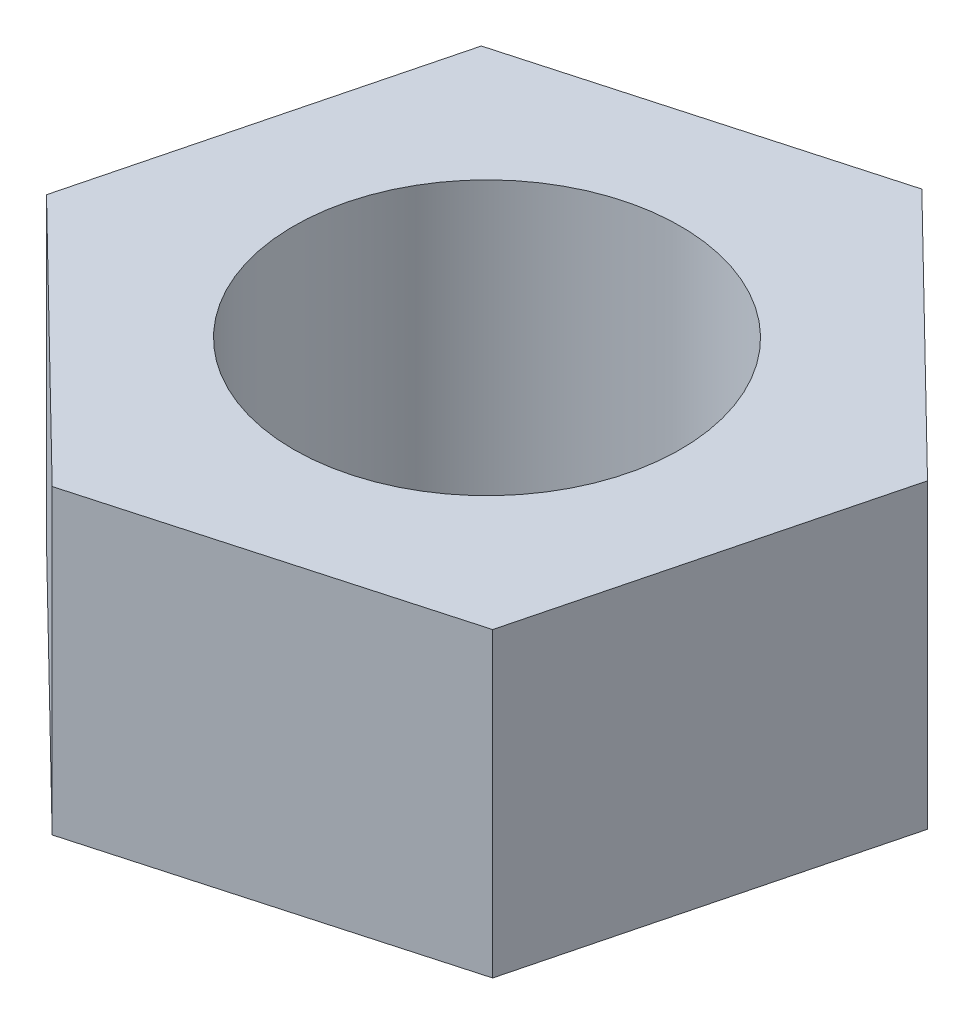
ISO-10303-21;
HEADER;
FILE_DESCRIPTION(('STEP AP214'),'2;1');
FILE_NAME('part.step','',(''),(''),'','','');
FILE_SCHEMA(('AUTOMOTIVE_DESIGN { 1 0 10303 214 1 1 1 1 }'));
ENDSEC;
DATA;
#1=APPLICATION_CONTEXT('core data for automotive mechanical design processes');
#2=APPLICATION_PROTOCOL_DEFINITION('international standard','automotive_design',2000,#1);
#3=PRODUCT_CONTEXT('',#1,'mechanical');
#4=PRODUCT('Part','Part','',(#3));
#5=PRODUCT_RELATED_PRODUCT_CATEGORY('part','',(#4));
#6=PRODUCT_DEFINITION_FORMATION('','',#4);
#7=PRODUCT_DEFINITION_CONTEXT('part definition',#1,'design');
#8=PRODUCT_DEFINITION('design','',#6,#7);
#9=PRODUCT_DEFINITION_SHAPE('','',#8);
#10=(LENGTH_UNIT() NAMED_UNIT(*) SI_UNIT(.MILLI.,.METRE.));
#11=(NAMED_UNIT(*) PLANE_ANGLE_UNIT() SI_UNIT($,.RADIAN.));
#12=(NAMED_UNIT(*) SI_UNIT($,.STERADIAN.) SOLID_ANGLE_UNIT());
#13=UNCERTAINTY_MEASURE_WITH_UNIT(LENGTH_MEASURE(1.E-05),#10,'distance_accuracy_value','');
#14=(GEOMETRIC_REPRESENTATION_CONTEXT(3) GLOBAL_UNCERTAINTY_ASSIGNED_CONTEXT((#13)) GLOBAL_UNIT_ASSIGNED_CONTEXT((#10,
#11,#12)) REPRESENTATION_CONTEXT('',''));
#15=CARTESIAN_POINT('',(0.,0.,0.));
#16=DIRECTION('',(0.,0.,1.));
#17=DIRECTION('',(1.,0.,0.));
#18=AXIS2_PLACEMENT_3D('',#15,#16,#17);
#19=CARTESIAN_POINT('',(0.,3.9,0.));
#20=DIRECTION('',(0.,1.,0.));
#21=DIRECTION('',(0.,0.,1.));
#22=AXIS2_PLACEMENT_3D('',#19,#20,#21);
#23=PLANE('',#22);
#24=DIRECTION('',(0.962956963986224,0.,-0.269655123278668));
#25=VECTOR('',#24,1.);
#26=CARTESIAN_POINT('',(-1.14523335638721,3.9,4.4745696879981));
#27=LINE('',#26,#25);
#28=CARTESIAN_POINT('',(-1.14523335638721,3.9,4.4745696879981));
#29=VERTEX_POINT('',#28);
#30=CARTESIAN_POINT('',(3.30247434261656,3.9,3.22908602389169));
#31=VERTEX_POINT('',#30);
#32=EDGE_CURVE('E146',#29,#31,#27,.T.);
#33=ORIENTED_EDGE('',*,*,#32,.T.);
#34=DIRECTION('',(0.247950294973161,0.,-0.968772755202541));
#35=VECTOR('',#34,1.);
#36=CARTESIAN_POINT('',(3.30247434261656,3.9,3.22908602389169));
#37=LINE('',#36,#35);
#38=CARTESIAN_POINT('',(4.44770769900377,3.9,-1.24548366410641));
#39=VERTEX_POINT('',#38);
#40=EDGE_CURVE('E94',#31,#39,#37,.T.);
#41=ORIENTED_EDGE('',*,*,#40,.T.);
#42=DIRECTION('',(-0.715006669013063,0.,-0.699117631923873));
#43=VECTOR('',#42,1.);
#44=CARTESIAN_POINT('',(4.44770769900377,3.9,-1.24548366410641));
#45=LINE('',#44,#43);
#46=CARTESIAN_POINT('',(1.14523335638721,3.9,-4.4745696879981));
#47=VERTEX_POINT('',#46);
#48=EDGE_CURVE('E107',#39,#47,#45,.T.);
#49=ORIENTED_EDGE('',*,*,#48,.T.);
#50=DIRECTION('',(-0.962956963986224,0.,0.269655123278668));
#51=VECTOR('',#50,1.);
#52=CARTESIAN_POINT('',(1.14523335638721,3.9,-4.4745696879981));
#53=LINE('',#52,#51);
#54=CARTESIAN_POINT('',(-3.30247434261656,3.9,-3.22908602389169));
#55=VERTEX_POINT('',#54);
#56=EDGE_CURVE('E101',#47,#55,#53,.T.);
#57=ORIENTED_EDGE('',*,*,#56,.T.);
#58=DIRECTION('',(-0.247950294973161,0.,0.968772755202541));
#59=VECTOR('',#58,1.);
#60=CARTESIAN_POINT('',(-3.30247434261656,3.9,-3.22908602389169));
#61=LINE('',#60,#59);
#62=CARTESIAN_POINT('',(-4.44770769900377,3.9,1.24548366410641));
#63=VERTEX_POINT('',#62);
#64=EDGE_CURVE('E105',#55,#63,#61,.T.);
#65=ORIENTED_EDGE('',*,*,#64,.T.);
#66=DIRECTION('',(0.715006669013063,0.,0.699117631923873));
#67=VECTOR('',#66,1.);
#68=CARTESIAN_POINT('',(-4.44770769900377,3.9,1.24548366410641));
#69=LINE('',#68,#67);
#70=EDGE_CURVE('E57',#63,#29,#69,.T.);
#71=ORIENTED_EDGE('',*,*,#70,.T.);
#72=EDGE_LOOP('',(#33,#41,#49,#57,#65,#71));
#73=FACE_BOUND('',#72,.T.);
#74=CARTESIAN_POINT('',(0.,3.9,0.));
#75=DIRECTION('',(0.,1.,0.));
#76=DIRECTION('',(0.,0.,1.));
#77=AXIS2_PLACEMENT_3D('',#74,#75,#76);
#78=CIRCLE('',#77,2.5);
#79=CARTESIAN_POINT('',(0.,3.9,2.5));
#80=VERTEX_POINT('',#79);
#81=EDGE_CURVE('E134',#80,#80,#78,.T.);
#82=ORIENTED_EDGE('',*,*,#81,.F.);
#83=EDGE_LOOP('',(#82));
#84=FACE_BOUND('',#83,.T.);
#85=ADVANCED_FACE('F39',(#73,#84),#23,.T.);
#86=CARTESIAN_POINT('',(0.,0.,0.));
#87=DIRECTION('',(0.,1.,0.));
#88=DIRECTION('',(0.,0.,1.));
#89=AXIS2_PLACEMENT_3D('',#86,#87,#88);
#90=PLANE('',#89);
#91=DIRECTION('',(0.962956963986224,0.,-0.269655123278668));
#92=VECTOR('',#91,1.);
#93=CARTESIAN_POINT('',(-1.14523335638721,0.,4.4745696879981));
#94=LINE('',#93,#92);
#95=CARTESIAN_POINT('',(-1.14523335638721,0.,4.4745696879981));
#96=VERTEX_POINT('',#95);
#97=CARTESIAN_POINT('',(3.30247434261656,0.,3.22908602389169));
#98=VERTEX_POINT('',#97);
#99=EDGE_CURVE('E129',#96,#98,#94,.T.);
#100=ORIENTED_EDGE('',*,*,#99,.F.);
#101=DIRECTION('',(0.715006669013063,0.,0.699117631923873));
#102=VECTOR('',#101,1.);
#103=CARTESIAN_POINT('',(-4.44770769900377,0.,1.24548366410641));
#104=LINE('',#103,#102);
#105=CARTESIAN_POINT('',(-4.44770769900377,0.,1.24548366410641));
#106=VERTEX_POINT('',#105);
#107=EDGE_CURVE('E86',#106,#96,#104,.T.);
#108=ORIENTED_EDGE('',*,*,#107,.F.);
#109=DIRECTION('',(-0.247950294973161,0.,0.968772755202541));
#110=VECTOR('',#109,1.);
#111=CARTESIAN_POINT('',(-3.30247434261656,0.,-3.22908602389169));
#112=LINE('',#111,#110);
#113=CARTESIAN_POINT('',(-3.30247434261656,0.,-3.22908602389169));
#114=VERTEX_POINT('',#113);
#115=EDGE_CURVE('E80',#114,#106,#112,.T.);
#116=ORIENTED_EDGE('',*,*,#115,.F.);
#117=DIRECTION('',(-0.962956963986224,0.,0.269655123278668));
#118=VECTOR('',#117,1.);
#119=CARTESIAN_POINT('',(1.14523335638721,0.,-4.4745696879981));
#120=LINE('',#119,#118);
#121=CARTESIAN_POINT('',(1.14523335638721,0.,-4.4745696879981));
#122=VERTEX_POINT('',#121);
#123=EDGE_CURVE('E116',#122,#114,#120,.T.);
#124=ORIENTED_EDGE('',*,*,#123,.F.);
#125=DIRECTION('',(-0.715006669013063,0.,-0.699117631923873));
#126=VECTOR('',#125,1.);
#127=CARTESIAN_POINT('',(4.44770769900377,0.,-1.24548366410641));
#128=LINE('',#127,#126);
#129=CARTESIAN_POINT('',(4.44770769900377,0.,-1.24548366410641));
#130=VERTEX_POINT('',#129);
#131=EDGE_CURVE('E137',#130,#122,#128,.T.);
#132=ORIENTED_EDGE('',*,*,#131,.F.);
#133=DIRECTION('',(0.247950294973161,0.,-0.968772755202541));
#134=VECTOR('',#133,1.);
#135=CARTESIAN_POINT('',(3.30247434261656,0.,3.22908602389169));
#136=LINE('',#135,#134);
#137=EDGE_CURVE('E133',#98,#130,#136,.T.);
#138=ORIENTED_EDGE('',*,*,#137,.F.);
#139=EDGE_LOOP('',(#100,#108,#116,#124,#132,#138));
#140=FACE_BOUND('',#139,.T.);
#141=CARTESIAN_POINT('',(0.,0.,0.));
#142=DIRECTION('',(0.,1.,0.));
#143=DIRECTION('',(0.,0.,1.));
#144=AXIS2_PLACEMENT_3D('',#141,#142,#143);
#145=CIRCLE('',#144,2.5);
#146=CARTESIAN_POINT('',(0.,0.,2.5));
#147=VERTEX_POINT('',#146);
#148=EDGE_CURVE('E243',#147,#147,#145,.T.);
#149=ORIENTED_EDGE('',*,*,#148,.T.);
#150=EDGE_LOOP('',(#149));
#151=FACE_BOUND('',#150,.T.);
#152=ADVANCED_FACE('F159',(#140,#151),#90,.F.);
#153=CARTESIAN_POINT('',(-1.14523335638721,3.9,4.4745696879981));
#154=DIRECTION('',(-0.269655123278668,0.,-0.962956963986224));
#155=DIRECTION('',(-0.962956963986224,0.,0.269655123278668));
#156=AXIS2_PLACEMENT_3D('',#153,#154,#155);
#157=PLANE('',#156);
#158=ORIENTED_EDGE('',*,*,#99,.T.);
#159=DIRECTION('',(0.,-1.,0.));
#160=VECTOR('',#159,1.);
#161=CARTESIAN_POINT('',(3.30247434261656,3.9,3.22908602389169));
#162=LINE('',#161,#160);
#163=EDGE_CURVE('E11',#31,#98,#162,.T.);
#164=ORIENTED_EDGE('',*,*,#163,.F.);
#165=ORIENTED_EDGE('',*,*,#32,.F.);
#166=DIRECTION('',(0.,-1.,0.));
#167=VECTOR('',#166,1.);
#168=CARTESIAN_POINT('',(-1.14523335638721,3.9,4.4745696879981));
#169=LINE('',#168,#167);
#170=EDGE_CURVE('E125',#29,#96,#169,.T.);
#171=ORIENTED_EDGE('',*,*,#170,.T.);
#172=EDGE_LOOP('',(#158,#164,#165,#171));
#173=FACE_BOUND('',#172,.T.);
#174=ADVANCED_FACE('F41',(#173),#157,.F.);
#175=CARTESIAN_POINT('',(3.30247434261656,3.9,3.22908602389169));
#176=DIRECTION('',(-0.968772755202541,0.,-0.247950294973161));
#177=DIRECTION('',(-0.247950294973161,0.,0.968772755202541));
#178=AXIS2_PLACEMENT_3D('',#175,#176,#177);
#179=PLANE('',#178);
#180=ORIENTED_EDGE('',*,*,#137,.T.);
#181=DIRECTION('',(0.,-1.,0.));
#182=VECTOR('',#181,1.);
#183=CARTESIAN_POINT('',(4.44770769900377,3.9,-1.24548366410641));
#184=LINE('',#183,#182);
#185=EDGE_CURVE('E49',#39,#130,#184,.T.);
#186=ORIENTED_EDGE('',*,*,#185,.F.);
#187=ORIENTED_EDGE('',*,*,#40,.F.);
#188=ORIENTED_EDGE('',*,*,#163,.T.);
#189=EDGE_LOOP('',(#180,#186,#187,#188));
#190=FACE_BOUND('',#189,.T.);
#191=ADVANCED_FACE('F184',(#190),#179,.F.);
#192=CARTESIAN_POINT('',(4.44770769900377,3.9,-1.24548366410641));
#193=DIRECTION('',(-0.699117631923873,0.,0.715006669013063));
#194=DIRECTION('',(0.715006669013063,0.,0.699117631923873));
#195=AXIS2_PLACEMENT_3D('',#192,#193,#194);
#196=PLANE('',#195);
#197=ORIENTED_EDGE('',*,*,#131,.T.);
#198=DIRECTION('',(0.,-1.,0.));
#199=VECTOR('',#198,1.);
#200=CARTESIAN_POINT('',(1.14523335638721,3.9,-4.4745696879981));
#201=LINE('',#200,#199);
#202=EDGE_CURVE('E118',#47,#122,#201,.T.);
#203=ORIENTED_EDGE('',*,*,#202,.F.);
#204=ORIENTED_EDGE('',*,*,#48,.F.);
#205=ORIENTED_EDGE('',*,*,#185,.T.);
#206=EDGE_LOOP('',(#197,#203,#204,#205));
#207=FACE_BOUND('',#206,.T.);
#208=ADVANCED_FACE('F156',(#207),#196,.F.);
#209=CARTESIAN_POINT('',(1.14523335638721,3.9,-4.4745696879981));
#210=DIRECTION('',(0.269655123278668,0.,0.962956963986224));
#211=DIRECTION('',(0.962956963986224,0.,-0.269655123278668));
#212=AXIS2_PLACEMENT_3D('',#209,#210,#211);
#213=PLANE('',#212);
#214=ORIENTED_EDGE('',*,*,#123,.T.);
#215=DIRECTION('',(0.,-1.,0.));
#216=VECTOR('',#215,1.);
#217=CARTESIAN_POINT('',(-3.30247434261656,3.9,-3.22908602389169));
#218=LINE('',#217,#216);
#219=EDGE_CURVE('E113',#55,#114,#218,.T.);
#220=ORIENTED_EDGE('',*,*,#219,.F.);
#221=ORIENTED_EDGE('',*,*,#56,.F.);
#222=ORIENTED_EDGE('',*,*,#202,.T.);
#223=EDGE_LOOP('',(#214,#220,#221,#222));
#224=FACE_BOUND('',#223,.T.);
#225=ADVANCED_FACE('F114',(#224),#213,.F.);
#226=CARTESIAN_POINT('',(-3.30247434261656,3.9,-3.22908602389169));
#227=DIRECTION('',(0.968772755202541,0.,0.247950294973161));
#228=DIRECTION('',(0.247950294973161,0.,-0.968772755202541));
#229=AXIS2_PLACEMENT_3D('',#226,#227,#228);
#230=PLANE('',#229);
#231=ORIENTED_EDGE('',*,*,#115,.T.);
#232=DIRECTION('',(0.,-1.,0.));
#233=VECTOR('',#232,1.);
#234=CARTESIAN_POINT('',(-4.44770769900377,3.9,1.24548366410641));
#235=LINE('',#234,#233);
#236=EDGE_CURVE('E119',#63,#106,#235,.T.);
#237=ORIENTED_EDGE('',*,*,#236,.F.);
#238=ORIENTED_EDGE('',*,*,#64,.F.);
#239=ORIENTED_EDGE('',*,*,#219,.T.);
#240=EDGE_LOOP('',(#231,#237,#238,#239));
#241=FACE_BOUND('',#240,.T.);
#242=ADVANCED_FACE('F121',(#241),#230,.F.);
#243=CARTESIAN_POINT('',(-4.44770769900377,3.9,1.24548366410641));
#244=DIRECTION('',(0.699117631923873,0.,-0.715006669013063));
#245=DIRECTION('',(-0.715006669013063,0.,-0.699117631923873));
#246=AXIS2_PLACEMENT_3D('',#243,#244,#245);
#247=PLANE('',#246);
#248=ORIENTED_EDGE('',*,*,#107,.T.);
#249=ORIENTED_EDGE('',*,*,#170,.F.);
#250=ORIENTED_EDGE('',*,*,#70,.F.);
#251=ORIENTED_EDGE('',*,*,#236,.T.);
#252=EDGE_LOOP('',(#248,#249,#250,#251));
#253=FACE_BOUND('',#252,.T.);
#254=ADVANCED_FACE('F164',(#253),#247,.F.);
#255=CARTESIAN_POINT('',(0.,3.9,0.));
#256=DIRECTION('',(0.,-1.,0.));
#257=DIRECTION('',(0.,0.,-1.));
#258=AXIS2_PLACEMENT_3D('',#255,#256,#257);
#259=CYLINDRICAL_SURFACE('',#258,2.5);
#260=ORIENTED_EDGE('',*,*,#81,.T.);
#261=EDGE_LOOP('',(#260));
#262=FACE_BOUND('',#261,.T.);
#263=ORIENTED_EDGE('',*,*,#148,.F.);
#264=EDGE_LOOP('',(#263));
#265=FACE_BOUND('',#264,.T.);
#266=ADVANCED_FACE('F166',(#262,#265),#259,.F.);
#267=CLOSED_SHELL('',(#85,#152,#174,#191,#208,#225,#242,#254,#266));
#268=MANIFOLD_SOLID_BREP('B2',#267);
#269=ADVANCED_BREP_SHAPE_REPRESENTATION('',(#18,#268),#14);
#270=SHAPE_DEFINITION_REPRESENTATION(#9,#269);
ENDSEC;
END-ISO-10303-21;
